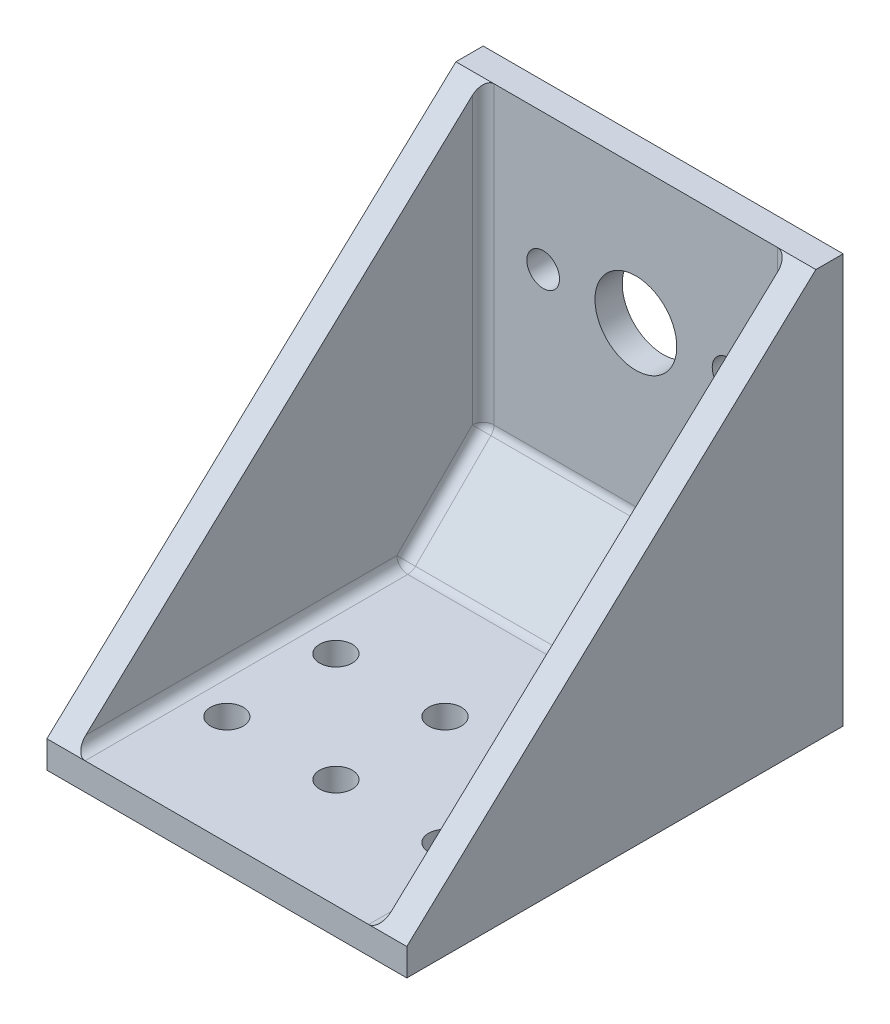
ISO-10303-21;
HEADER;
FILE_DESCRIPTION(('STEP AP214'),'2;1');
FILE_NAME('part.step','',(''),(''),'','','');
FILE_SCHEMA(('AUTOMOTIVE_DESIGN { 1 0 10303 214 1 1 1 1 }'));
ENDSEC;
DATA;
#1=APPLICATION_CONTEXT('core data for automotive mechanical design processes');
#2=APPLICATION_PROTOCOL_DEFINITION('international standard','automotive_design',2000,#1);
#3=PRODUCT_CONTEXT('',#1,'mechanical');
#4=PRODUCT('Part','Part','',(#3));
#5=PRODUCT_RELATED_PRODUCT_CATEGORY('part','',(#4));
#6=PRODUCT_DEFINITION_FORMATION('','',#4);
#7=PRODUCT_DEFINITION_CONTEXT('part definition',#1,'design');
#8=PRODUCT_DEFINITION('design','',#6,#7);
#9=PRODUCT_DEFINITION_SHAPE('','',#8);
#10=(LENGTH_UNIT() NAMED_UNIT(*) SI_UNIT(.MILLI.,.METRE.));
#11=(NAMED_UNIT(*) PLANE_ANGLE_UNIT() SI_UNIT($,.RADIAN.));
#12=(NAMED_UNIT(*) SI_UNIT($,.STERADIAN.) SOLID_ANGLE_UNIT());
#13=UNCERTAINTY_MEASURE_WITH_UNIT(LENGTH_MEASURE(1.E-05),#10,'distance_accuracy_value','');
#14=(GEOMETRIC_REPRESENTATION_CONTEXT(3) GLOBAL_UNCERTAINTY_ASSIGNED_CONTEXT((#13)) GLOBAL_UNIT_ASSIGNED_CONTEXT((#10,
#11,#12)) REPRESENTATION_CONTEXT('',''));
#15=CARTESIAN_POINT('',(0.,0.,0.));
#16=DIRECTION('',(0.,0.,1.));
#17=DIRECTION('',(1.,0.,0.));
#18=AXIS2_PLACEMENT_3D('',#15,#16,#17);
#19=CARTESIAN_POINT('',(28.,0.,0.));
#20=DIRECTION('',(0.,0.,1.));
#21=DIRECTION('',(0.,-1.,0.));
#22=AXIS2_PLACEMENT_3D('',#19,#20,#21);
#23=PLANE('',#22);
#24=CARTESIAN_POINT('',(22.5,25.,0.));
#25=DIRECTION('',(0.,0.,-1.));
#26=DIRECTION('',(0.,1.,0.));
#27=AXIS2_PLACEMENT_3D('',#24,#25,#26);
#28=CIRCLE('',#27,1.49999999999999);
#29=CARTESIAN_POINT('',(22.5,26.5,0.));
#30=VERTEX_POINT('',#29);
#31=EDGE_CURVE('E232',#30,#30,#28,.T.);
#32=ORIENTED_EDGE('',*,*,#31,.F.);
#33=EDGE_LOOP('',(#32));
#34=FACE_BOUND('',#33,.T.);
#35=CARTESIAN_POINT('',(5.5,25.,0.));
#36=DIRECTION('',(0.,0.,-1.));
#37=DIRECTION('',(0.,1.,0.));
#38=AXIS2_PLACEMENT_3D('',#35,#36,#37);
#39=CIRCLE('',#38,1.49999999999999);
#40=CARTESIAN_POINT('',(5.5,26.5,0.));
#41=VERTEX_POINT('',#40);
#42=EDGE_CURVE('E228',#41,#41,#39,.T.);
#43=ORIENTED_EDGE('',*,*,#42,.F.);
#44=EDGE_LOOP('',(#43));
#45=FACE_BOUND('',#44,.T.);
#46=CARTESIAN_POINT('',(14.,25.,0.));
#47=DIRECTION('',(0.,0.,-1.));
#48=DIRECTION('',(0.,1.,0.));
#49=AXIS2_PLACEMENT_3D('',#46,#47,#48);
#50=CIRCLE('',#49,3.74999999999999);
#51=CARTESIAN_POINT('',(14.,28.75,0.));
#52=VERTEX_POINT('',#51);
#53=EDGE_CURVE('E227',#52,#52,#50,.T.);
#54=ORIENTED_EDGE('',*,*,#53,.F.);
#55=EDGE_LOOP('',(#54));
#56=FACE_BOUND('',#55,.T.);
#57=DIRECTION('',(0.,1.,0.));
#58=VECTOR('',#57,1.);
#59=CARTESIAN_POINT('',(30.5,37.5,0.));
#60=LINE('',#59,#58);
#61=CARTESIAN_POINT('',(30.5,0.,0.));
#62=VERTEX_POINT('',#61);
#63=CARTESIAN_POINT('',(30.5,37.5,0.));
#64=VERTEX_POINT('',#63);
#65=EDGE_CURVE('E145',#62,#64,#60,.T.);
#66=ORIENTED_EDGE('',*,*,#65,.F.);
#67=DIRECTION('',(1.,0.,0.));
#68=VECTOR('',#67,1.);
#69=CARTESIAN_POINT('',(30.5,0.,0.));
#70=LINE('',#69,#68);
#71=CARTESIAN_POINT('',(-2.5,0.,0.));
#72=VERTEX_POINT('',#71);
#73=EDGE_CURVE('E149',#72,#62,#70,.T.);
#74=ORIENTED_EDGE('',*,*,#73,.F.);
#75=DIRECTION('',(0.,-1.,0.));
#76=VECTOR('',#75,1.);
#77=CARTESIAN_POINT('',(-2.5,2.5,0.));
#78=LINE('',#77,#76);
#79=CARTESIAN_POINT('',(-2.5,37.5,0.));
#80=VERTEX_POINT('',#79);
#81=EDGE_CURVE('E188',#80,#72,#78,.T.);
#82=ORIENTED_EDGE('',*,*,#81,.F.);
#83=DIRECTION('',(-1.,0.,0.));
#84=VECTOR('',#83,1.);
#85=CARTESIAN_POINT('',(0.,37.5,0.));
#86=LINE('',#85,#84);
#87=EDGE_CURVE('E150',#64,#80,#86,.T.);
#88=ORIENTED_EDGE('',*,*,#87,.F.);
#89=EDGE_LOOP('',(#66,#74,#82,#88));
#90=FACE_BOUND('',#89,.T.);
#91=ADVANCED_FACE('F40',(#34,#45,#56,#90),#23,.F.);
#92=CARTESIAN_POINT('',(28.,10.,2.49999999999999));
#93=DIRECTION('',(0.,-0.707106781186548,-0.707106781186548));
#94=DIRECTION('',(0.,0.707106781186548,-0.707106781186548));
#95=AXIS2_PLACEMENT_3D('',#92,#93,#94);
#96=PLANE('',#95);
#97=DIRECTION('',(1.,0.,0.));
#98=VECTOR('',#97,1.);
#99=CARTESIAN_POINT('',(0.,9.70710678118655,2.79289321881345));
#100=LINE('',#99,#98);
#101=CARTESIAN_POINT('',(27.,9.70710678118655,2.79289321881345));
#102=VERTEX_POINT('',#101);
#103=CARTESIAN_POINT('',(1.,9.70710678118655,2.79289321881345));
#104=VERTEX_POINT('',#103);
#105=EDGE_CURVE('E247',#102,#104,#100,.F.);
#106=ORIENTED_EDGE('',*,*,#105,.T.);
#107=DIRECTION('',(0.,-0.707106781186548,0.707106781186548));
#108=VECTOR('',#107,1.);
#109=CARTESIAN_POINT('',(1.,2.5,10.));
#110=LINE('',#109,#108);
#111=CARTESIAN_POINT('',(1.,2.79289321881345,9.70710678118655));
#112=VERTEX_POINT('',#111);
#113=EDGE_CURVE('E251',#104,#112,#110,.T.);
#114=ORIENTED_EDGE('',*,*,#113,.T.);
#115=DIRECTION('',(1.,0.,0.));
#116=VECTOR('',#115,1.);
#117=CARTESIAN_POINT('',(28.,2.79289321881345,9.70710678118655));
#118=LINE('',#117,#116);
#119=CARTESIAN_POINT('',(27.,2.79289321881345,9.70710678118655));
#120=VERTEX_POINT('',#119);
#121=EDGE_CURVE('E249',#112,#120,#118,.T.);
#122=ORIENTED_EDGE('',*,*,#121,.T.);
#123=DIRECTION('',(0.,0.707106781186548,-0.707106781186548));
#124=VECTOR('',#123,1.);
#125=CARTESIAN_POINT('',(27.,10.,2.49999999999999));
#126=LINE('',#125,#124);
#127=EDGE_CURVE('E245',#120,#102,#126,.T.);
#128=ORIENTED_EDGE('',*,*,#127,.T.);
#129=EDGE_LOOP('',(#106,#114,#122,#128));
#130=FACE_BOUND('',#129,.T.);
#131=ADVANCED_FACE('F390',(#130),#96,.F.);
#132=CARTESIAN_POINT('',(28.,37.5,2.5));
#133=DIRECTION('',(0.,0.,-1.));
#134=DIRECTION('',(-1.,0.,0.));
#135=AXIS2_PLACEMENT_3D('',#132,#133,#134);
#136=PLANE('',#135);
#137=CARTESIAN_POINT('',(22.5,25.,2.5));
#138=DIRECTION('',(0.,0.,-1.));
#139=DIRECTION('',(-1.,0.,0.));
#140=AXIS2_PLACEMENT_3D('',#137,#138,#139);
#141=CIRCLE('',#140,1.49999999999999);
#142=CARTESIAN_POINT('',(21.,25.,2.5));
#143=VERTEX_POINT('',#142);
#144=EDGE_CURVE('E229',#143,#143,#141,.T.);
#145=ORIENTED_EDGE('',*,*,#144,.T.);
#146=EDGE_LOOP('',(#145));
#147=FACE_BOUND('',#146,.T.);
#148=CARTESIAN_POINT('',(5.5,25.,2.5));
#149=DIRECTION('',(0.,0.,-1.));
#150=DIRECTION('',(-1.,0.,0.));
#151=AXIS2_PLACEMENT_3D('',#148,#149,#150);
#152=CIRCLE('',#151,1.49999999999999);
#153=CARTESIAN_POINT('',(4.00000000000001,25.,2.5));
#154=VERTEX_POINT('',#153);
#155=EDGE_CURVE('E224',#154,#154,#152,.T.);
#156=ORIENTED_EDGE('',*,*,#155,.T.);
#157=EDGE_LOOP('',(#156));
#158=FACE_BOUND('',#157,.T.);
#159=CARTESIAN_POINT('',(14.,25.,2.5));
#160=DIRECTION('',(0.,0.,-1.));
#161=DIRECTION('',(-1.,0.,0.));
#162=AXIS2_PLACEMENT_3D('',#159,#160,#161);
#163=CIRCLE('',#162,3.74999999999998);
#164=CARTESIAN_POINT('',(10.25,25.,2.5));
#165=VERTEX_POINT('',#164);
#166=EDGE_CURVE('E321',#165,#165,#163,.T.);
#167=ORIENTED_EDGE('',*,*,#166,.T.);
#168=EDGE_LOOP('',(#167));
#169=FACE_BOUND('',#168,.T.);
#170=DIRECTION('',(1.,0.,0.));
#171=VECTOR('',#170,1.);
#172=CARTESIAN_POINT('',(28.,37.5,2.5));
#173=LINE('',#172,#171);
#174=CARTESIAN_POINT('',(1.,37.5,2.5));
#175=VERTEX_POINT('',#174);
#176=CARTESIAN_POINT('',(27.,37.5,2.5));
#177=VERTEX_POINT('',#176);
#178=EDGE_CURVE('E206',#175,#177,#173,.T.);
#179=ORIENTED_EDGE('',*,*,#178,.F.);
#180=DIRECTION('',(0.,-1.,0.));
#181=VECTOR('',#180,1.);
#182=CARTESIAN_POINT('',(1.,10.,2.5));
#183=LINE('',#182,#181);
#184=CARTESIAN_POINT('',(1.,10.4142135623731,2.5));
#185=VERTEX_POINT('',#184);
#186=EDGE_CURVE('E259',#175,#185,#183,.T.);
#187=ORIENTED_EDGE('',*,*,#186,.T.);
#188=DIRECTION('',(1.,0.,0.));
#189=VECTOR('',#188,1.);
#190=CARTESIAN_POINT('',(28.,10.4142135623731,2.5));
#191=LINE('',#190,#189);
#192=CARTESIAN_POINT('',(27.,10.4142135623731,2.5));
#193=VERTEX_POINT('',#192);
#194=EDGE_CURVE('E257',#185,#193,#191,.T.);
#195=ORIENTED_EDGE('',*,*,#194,.T.);
#196=DIRECTION('',(0.,-1.,0.));
#197=VECTOR('',#196,1.);
#198=CARTESIAN_POINT('',(27.,37.5,2.5));
#199=LINE('',#198,#197);
#200=EDGE_CURVE('E254',#193,#177,#199,.F.);
#201=ORIENTED_EDGE('',*,*,#200,.T.);
#202=EDGE_LOOP('',(#179,#187,#195,#201));
#203=FACE_BOUND('',#202,.T.);
#204=ADVANCED_FACE('F396',(#147,#158,#169,#203),#136,.F.);
#205=CARTESIAN_POINT('',(0.,37.5,0.));
#206=DIRECTION('',(0.,-1.,0.));
#207=DIRECTION('',(0.,0.,-1.));
#208=AXIS2_PLACEMENT_3D('',#205,#206,#207);
#209=PLANE('',#208);
#210=ORIENTED_EDGE('',*,*,#87,.T.);
#211=DIRECTION('',(0.,0.,-1.));
#212=VECTOR('',#211,1.);
#213=CARTESIAN_POINT('',(-2.5,37.5,0.));
#214=LINE('',#213,#212);
#215=CARTESIAN_POINT('',(-2.5,37.5,2.5));
#216=VERTEX_POINT('',#215);
#217=EDGE_CURVE('E185',#216,#80,#214,.T.);
#218=ORIENTED_EDGE('',*,*,#217,.F.);
#219=DIRECTION('',(1.,0.,0.));
#220=VECTOR('',#219,1.);
#221=CARTESIAN_POINT('',(-2.5,37.5,2.5));
#222=LINE('',#221,#220);
#223=EDGE_CURVE('E194',#216,#175,#222,.T.);
#224=ORIENTED_EDGE('',*,*,#223,.T.);
#225=ORIENTED_EDGE('',*,*,#178,.T.);
#226=DIRECTION('',(-1.,0.,0.));
#227=VECTOR('',#226,1.);
#228=CARTESIAN_POINT('',(30.5,37.5,2.5));
#229=LINE('',#228,#227);
#230=CARTESIAN_POINT('',(30.5,37.5,2.5));
#231=VERTEX_POINT('',#230);
#232=EDGE_CURVE('E202',#231,#177,#229,.T.);
#233=ORIENTED_EDGE('',*,*,#232,.F.);
#234=DIRECTION('',(0.,0.,1.));
#235=VECTOR('',#234,1.);
#236=CARTESIAN_POINT('',(30.5,37.5,2.5));
#237=LINE('',#236,#235);
#238=EDGE_CURVE('E153',#64,#231,#237,.T.);
#239=ORIENTED_EDGE('',*,*,#238,.F.);
#240=EDGE_LOOP('',(#210,#218,#224,#225,#233,#239));
#241=FACE_BOUND('',#240,.T.);
#242=ADVANCED_FACE('F676',(#241),#209,.F.);
#243=CARTESIAN_POINT('',(30.5,2.5,40.));
#244=DIRECTION('',(0.,-0.731055268242869,-0.682318250360011));
#245=DIRECTION('',(0.,0.682318250360011,-0.731055268242869));
#246=AXIS2_PLACEMENT_3D('',#243,#244,#245);
#247=PLANE('',#246);
#248=ORIENTED_EDGE('',*,*,#232,.T.);
#249=CARTESIAN_POINT('',(27.,36.5666666666667,3.5));
#250=DIRECTION('',(0.,-0.731055268242869,-0.682318250360011));
#251=DIRECTION('',(0.,-0.682318250360011,0.731055268242869));
#252=AXIS2_PLACEMENT_3D('',#249,#250,#251);
#253=ELLIPSE('',#252,1.36788563524555,1.);
#254=CARTESIAN_POINT('',(28.,36.5666666666667,3.49999999999999));
#255=VERTEX_POINT('',#254);
#256=EDGE_CURVE('E12',#177,#255,#253,.T.);
#257=ORIENTED_EDGE('',*,*,#256,.T.);
#258=DIRECTION('',(0.,-0.682318250360011,0.731055268242869));
#259=VECTOR('',#258,1.);
#260=CARTESIAN_POINT('',(28.,2.5,40.));
#261=LINE('',#260,#259);
#262=CARTESIAN_POINT('',(28.,3.5,38.9285714285714));
#263=VERTEX_POINT('',#262);
#264=EDGE_CURVE('E154',#255,#263,#261,.T.);
#265=ORIENTED_EDGE('',*,*,#264,.T.);
#266=CARTESIAN_POINT('',(27.,3.5,38.9285714285714));
#267=DIRECTION('',(0.,-0.731055268242869,-0.682318250360011));
#268=DIRECTION('',(0.,-0.682318250360011,0.731055268242869));
#269=AXIS2_PLACEMENT_3D('',#266,#267,#268);
#270=ELLIPSE('',#269,1.4655917520488,1.);
#271=CARTESIAN_POINT('',(27.,2.5,40.));
#272=VERTEX_POINT('',#271);
#273=EDGE_CURVE('E50',#263,#272,#270,.T.);
#274=ORIENTED_EDGE('',*,*,#273,.T.);
#275=DIRECTION('',(-1.,0.,0.));
#276=VECTOR('',#275,1.);
#277=CARTESIAN_POINT('',(30.5,2.5,40.));
#278=LINE('',#277,#276);
#279=CARTESIAN_POINT('',(30.5,2.5,40.));
#280=VERTEX_POINT('',#279);
#281=EDGE_CURVE('E58',#280,#272,#278,.T.);
#282=ORIENTED_EDGE('',*,*,#281,.F.);
#283=DIRECTION('',(0.,-0.682318250360011,0.731055268242869));
#284=VECTOR('',#283,1.);
#285=CARTESIAN_POINT('',(30.5,2.5,40.));
#286=LINE('',#285,#284);
#287=EDGE_CURVE('E197',#231,#280,#286,.T.);
#288=ORIENTED_EDGE('',*,*,#287,.F.);
#289=EDGE_LOOP('',(#248,#257,#265,#274,#282,#288));
#290=FACE_BOUND('',#289,.T.);
#291=ADVANCED_FACE('F402',(#290),#247,.F.);
#292=CARTESIAN_POINT('',(30.5,0.,0.));
#293=DIRECTION('',(-1.,0.,0.));
#294=DIRECTION('',(0.,0.,1.));
#295=AXIS2_PLACEMENT_3D('',#292,#293,#294);
#296=PLANE('',#295);
#297=ORIENTED_EDGE('',*,*,#65,.T.);
#298=ORIENTED_EDGE('',*,*,#238,.T.);
#299=ORIENTED_EDGE('',*,*,#287,.T.);
#300=DIRECTION('',(0.,1.,0.));
#301=VECTOR('',#300,1.);
#302=CARTESIAN_POINT('',(30.5,0.,40.));
#303=LINE('',#302,#301);
#304=CARTESIAN_POINT('',(30.5,0.,40.));
#305=VERTEX_POINT('',#304);
#306=EDGE_CURVE('E159',#305,#280,#303,.T.);
#307=ORIENTED_EDGE('',*,*,#306,.F.);
#308=DIRECTION('',(0.,0.,1.));
#309=VECTOR('',#308,1.);
#310=CARTESIAN_POINT('',(30.5,0.,40.));
#311=LINE('',#310,#309);
#312=EDGE_CURVE('E157',#62,#305,#311,.T.);
#313=ORIENTED_EDGE('',*,*,#312,.F.);
#314=EDGE_LOOP('',(#297,#298,#299,#307,#313));
#315=FACE_BOUND('',#314,.T.);
#316=ADVANCED_FACE('F158',(#315),#296,.F.);
#317=CARTESIAN_POINT('',(28.,0.,0.));
#318=DIRECTION('',(-1.,0.,0.));
#319=DIRECTION('',(0.,0.,1.));
#320=AXIS2_PLACEMENT_3D('',#317,#318,#319);
#321=PLANE('',#320);
#322=DIRECTION('',(0.,0.707106781186548,-0.707106781186548));
#323=VECTOR('',#322,1.);
#324=CARTESIAN_POINT('',(28.,6.95710678118655,6.95710678118655));
#325=LINE('',#324,#323);
#326=CARTESIAN_POINT('',(28.,10.4142135623731,3.5));
#327=VERTEX_POINT('',#326);
#328=CARTESIAN_POINT('',(28.,3.5,10.4142135623731));
#329=VERTEX_POINT('',#328);
#330=EDGE_CURVE('E263',#327,#329,#325,.F.);
#331=ORIENTED_EDGE('',*,*,#330,.T.);
#332=DIRECTION('',(0.,0.,-1.));
#333=VECTOR('',#332,1.);
#334=CARTESIAN_POINT('',(28.,3.5,40.));
#335=LINE('',#334,#333);
#336=EDGE_CURVE('E265',#329,#263,#335,.F.);
#337=ORIENTED_EDGE('',*,*,#336,.T.);
#338=ORIENTED_EDGE('',*,*,#264,.F.);
#339=DIRECTION('',(0.,-1.,0.));
#340=VECTOR('',#339,1.);
#341=CARTESIAN_POINT('',(28.,0.,3.5));
#342=LINE('',#341,#340);
#343=EDGE_CURVE('E261',#255,#327,#342,.T.);
#344=ORIENTED_EDGE('',*,*,#343,.T.);
#345=EDGE_LOOP('',(#331,#337,#338,#344));
#346=FACE_BOUND('',#345,.T.);
#347=ADVANCED_FACE('F407',(#346),#321,.T.);
#348=CARTESIAN_POINT('',(-2.5,37.5,2.5));
#349=DIRECTION('',(0.,-0.731055268242869,-0.682318250360011));
#350=DIRECTION('',(0.,0.682318250360011,-0.731055268242869));
#351=AXIS2_PLACEMENT_3D('',#348,#349,#350);
#352=PLANE('',#351);
#353=DIRECTION('',(1.,0.,0.));
#354=VECTOR('',#353,1.);
#355=CARTESIAN_POINT('',(-2.5,2.5,40.));
#356=LINE('',#355,#354);
#357=CARTESIAN_POINT('',(-2.5,2.5,40.));
#358=VERTEX_POINT('',#357);
#359=CARTESIAN_POINT('',(1.,2.5,40.));
#360=VERTEX_POINT('',#359);
#361=EDGE_CURVE('E190',#358,#360,#356,.T.);
#362=ORIENTED_EDGE('',*,*,#361,.T.);
#363=CARTESIAN_POINT('',(1.,3.5,38.9285714285714));
#364=DIRECTION('',(0.,-0.731055268242869,-0.682318250360011));
#365=DIRECTION('',(0.,-0.682318250360011,0.731055268242869));
#366=AXIS2_PLACEMENT_3D('',#363,#364,#365);
#367=ELLIPSE('',#366,1.4655917520488,1.);
#368=CARTESIAN_POINT('',(0.,3.5,38.9285714285714));
#369=VERTEX_POINT('',#368);
#370=EDGE_CURVE('E267',#360,#369,#367,.T.);
#371=ORIENTED_EDGE('',*,*,#370,.T.);
#372=DIRECTION('',(0.,0.682318250360011,-0.731055268242869));
#373=VECTOR('',#372,1.);
#374=CARTESIAN_POINT('',(0.,37.5,2.5));
#375=LINE('',#374,#373);
#376=CARTESIAN_POINT('',(0.,36.5666666666667,3.5));
#377=VERTEX_POINT('',#376);
#378=EDGE_CURVE('E181',#369,#377,#375,.T.);
#379=ORIENTED_EDGE('',*,*,#378,.T.);
#380=CARTESIAN_POINT('',(1.,36.5666666666667,3.5));
#381=DIRECTION('',(0.,-0.731055268242869,-0.682318250360011));
#382=DIRECTION('',(0.,0.682318250360011,-0.731055268242869));
#383=AXIS2_PLACEMENT_3D('',#380,#381,#382);
#384=ELLIPSE('',#383,1.36788563524555,1.);
#385=EDGE_CURVE('E269',#377,#175,#384,.T.);
#386=ORIENTED_EDGE('',*,*,#385,.T.);
#387=ORIENTED_EDGE('',*,*,#223,.F.);
#388=DIRECTION('',(0.,0.682318250360011,-0.731055268242869));
#389=VECTOR('',#388,1.);
#390=CARTESIAN_POINT('',(-2.5,37.5,2.5));
#391=LINE('',#390,#389);
#392=EDGE_CURVE('E182',#358,#216,#391,.T.);
#393=ORIENTED_EDGE('',*,*,#392,.F.);
#394=EDGE_LOOP('',(#362,#371,#379,#386,#387,#393));
#395=FACE_BOUND('',#394,.T.);
#396=ADVANCED_FACE('F371',(#395),#352,.F.);
#397=CARTESIAN_POINT('',(-2.5,0.,0.));
#398=DIRECTION('',(-1.,0.,0.));
#399=DIRECTION('',(0.,0.,1.));
#400=AXIS2_PLACEMENT_3D('',#397,#398,#399);
#401=PLANE('',#400);
#402=ORIENTED_EDGE('',*,*,#392,.T.);
#403=ORIENTED_EDGE('',*,*,#217,.T.);
#404=ORIENTED_EDGE('',*,*,#81,.T.);
#405=DIRECTION('',(0.,0.,-1.));
#406=VECTOR('',#405,1.);
#407=CARTESIAN_POINT('',(-2.5,0.,0.));
#408=LINE('',#407,#406);
#409=CARTESIAN_POINT('',(-2.5,0.,40.));
#410=VERTEX_POINT('',#409);
#411=EDGE_CURVE('E167',#410,#72,#408,.T.);
#412=ORIENTED_EDGE('',*,*,#411,.F.);
#413=DIRECTION('',(0.,1.,0.));
#414=VECTOR('',#413,1.);
#415=CARTESIAN_POINT('',(-2.5,0.,40.));
#416=LINE('',#415,#414);
#417=EDGE_CURVE('E176',#410,#358,#416,.T.);
#418=ORIENTED_EDGE('',*,*,#417,.T.);
#419=EDGE_LOOP('',(#402,#403,#404,#412,#418));
#420=FACE_BOUND('',#419,.T.);
#421=ADVANCED_FACE('F619',(#420),#401,.T.);
#422=CARTESIAN_POINT('',(0.,0.,0.));
#423=DIRECTION('',(-1.,0.,0.));
#424=DIRECTION('',(0.,0.,1.));
#425=AXIS2_PLACEMENT_3D('',#422,#423,#424);
#426=PLANE('',#425);
#427=ORIENTED_EDGE('',*,*,#378,.F.);
#428=DIRECTION('',(0.,0.,1.));
#429=VECTOR('',#428,1.);
#430=CARTESIAN_POINT('',(0.,3.5,0.));
#431=LINE('',#430,#429);
#432=CARTESIAN_POINT('',(0.,3.5,10.4142135623731));
#433=VERTEX_POINT('',#432);
#434=EDGE_CURVE('E243',#369,#433,#431,.F.);
#435=ORIENTED_EDGE('',*,*,#434,.T.);
#436=DIRECTION('',(0.,-0.707106781186548,0.707106781186548));
#437=VECTOR('',#436,1.);
#438=CARTESIAN_POINT('',(0.,10.7071067811866,3.20710678118654));
#439=LINE('',#438,#437);
#440=CARTESIAN_POINT('',(0.,10.4142135623731,3.5));
#441=VERTEX_POINT('',#440);
#442=EDGE_CURVE('E241',#433,#441,#439,.F.);
#443=ORIENTED_EDGE('',*,*,#442,.T.);
#444=DIRECTION('',(0.,-1.,0.));
#445=VECTOR('',#444,1.);
#446=CARTESIAN_POINT('',(0.,37.5,3.5));
#447=LINE('',#446,#445);
#448=EDGE_CURVE('E239',#441,#377,#447,.F.);
#449=ORIENTED_EDGE('',*,*,#448,.T.);
#450=EDGE_LOOP('',(#427,#435,#443,#449));
#451=FACE_BOUND('',#450,.T.);
#452=ADVANCED_FACE('F375',(#451),#426,.F.);
#453=CARTESIAN_POINT('',(-2.5,0.,40.));
#454=DIRECTION('',(0.,0.,-1.));
#455=DIRECTION('',(0.,1.,0.));
#456=AXIS2_PLACEMENT_3D('',#453,#454,#455);
#457=PLANE('',#456);
#458=ORIENTED_EDGE('',*,*,#281,.T.);
#459=DIRECTION('',(-1.,0.,0.));
#460=VECTOR('',#459,1.);
#461=CARTESIAN_POINT('',(-2.5,2.5,40.));
#462=LINE('',#461,#460);
#463=EDGE_CURVE('E168',#272,#360,#462,.T.);
#464=ORIENTED_EDGE('',*,*,#463,.T.);
#465=ORIENTED_EDGE('',*,*,#361,.F.);
#466=ORIENTED_EDGE('',*,*,#417,.F.);
#467=DIRECTION('',(-1.,0.,0.));
#468=VECTOR('',#467,1.);
#469=CARTESIAN_POINT('',(-2.5,0.,40.));
#470=LINE('',#469,#468);
#471=EDGE_CURVE('E162',#305,#410,#470,.T.);
#472=ORIENTED_EDGE('',*,*,#471,.F.);
#473=ORIENTED_EDGE('',*,*,#306,.T.);
#474=EDGE_LOOP('',(#458,#464,#465,#466,#472,#473));
#475=FACE_BOUND('',#474,.T.);
#476=ADVANCED_FACE('F607',(#475),#457,.F.);
#477=CARTESIAN_POINT('',(0.,0.,0.));
#478=DIRECTION('',(0.,1.,0.));
#479=DIRECTION('',(0.,0.,1.));
#480=AXIS2_PLACEMENT_3D('',#477,#478,#479);
#481=PLANE('',#480);
#482=CARTESIAN_POINT('',(3.99999999999997,0.,29.9999999999999));
#483=DIRECTION('',(0.,-1.,0.));
#484=DIRECTION('',(0.,0.,-1.));
#485=AXIS2_PLACEMENT_3D('',#482,#483,#484);
#486=CIRCLE('',#485,1.49999999999999);
#487=CARTESIAN_POINT('',(3.99999999999997,0.,28.4999999999999));
#488=VERTEX_POINT('',#487);
#489=EDGE_CURVE('E223',#488,#488,#486,.T.);
#490=ORIENTED_EDGE('',*,*,#489,.F.);
#491=EDGE_LOOP('',(#490));
#492=FACE_BOUND('',#491,.T.);
#493=CARTESIAN_POINT('',(4.,0.,19.9999999999999));
#494=DIRECTION('',(0.,-1.,0.));
#495=DIRECTION('',(0.,0.,-1.));
#496=AXIS2_PLACEMENT_3D('',#493,#494,#495);
#497=CIRCLE('',#496,1.49999999999999);
#498=CARTESIAN_POINT('',(4.,0.,18.4999999999999));
#499=VERTEX_POINT('',#498);
#500=EDGE_CURVE('E222',#499,#499,#497,.T.);
#501=ORIENTED_EDGE('',*,*,#500,.F.);
#502=EDGE_LOOP('',(#501));
#503=FACE_BOUND('',#502,.T.);
#504=CARTESIAN_POINT('',(14.,0.,29.9999999999999));
#505=DIRECTION('',(0.,-1.,0.));
#506=DIRECTION('',(0.,0.,-1.));
#507=AXIS2_PLACEMENT_3D('',#504,#505,#506);
#508=CIRCLE('',#507,1.49999999999999);
#509=CARTESIAN_POINT('',(14.,0.,28.4999999999999));
#510=VERTEX_POINT('',#509);
#511=EDGE_CURVE('E218',#510,#510,#508,.T.);
#512=ORIENTED_EDGE('',*,*,#511,.F.);
#513=EDGE_LOOP('',(#512));
#514=FACE_BOUND('',#513,.T.);
#515=CARTESIAN_POINT('',(14.,0.,19.9999999999999));
#516=DIRECTION('',(0.,-1.,0.));
#517=DIRECTION('',(0.,0.,-1.));
#518=AXIS2_PLACEMENT_3D('',#515,#516,#517);
#519=CIRCLE('',#518,1.49999999999999);
#520=CARTESIAN_POINT('',(14.,0.,18.4999999999999));
#521=VERTEX_POINT('',#520);
#522=EDGE_CURVE('E214',#521,#521,#519,.T.);
#523=ORIENTED_EDGE('',*,*,#522,.F.);
#524=EDGE_LOOP('',(#523));
#525=FACE_BOUND('',#524,.T.);
#526=CARTESIAN_POINT('',(24.,0.,30.));
#527=DIRECTION('',(0.,-1.,0.));
#528=DIRECTION('',(0.,0.,-1.));
#529=AXIS2_PLACEMENT_3D('',#526,#527,#528);
#530=CIRCLE('',#529,1.49999999999999);
#531=CARTESIAN_POINT('',(24.,0.,28.5));
#532=VERTEX_POINT('',#531);
#533=EDGE_CURVE('E213',#532,#532,#530,.T.);
#534=ORIENTED_EDGE('',*,*,#533,.F.);
#535=EDGE_LOOP('',(#534));
#536=FACE_BOUND('',#535,.T.);
#537=CARTESIAN_POINT('',(24.,0.,20.));
#538=DIRECTION('',(0.,-1.,0.));
#539=DIRECTION('',(0.,0.,-1.));
#540=AXIS2_PLACEMENT_3D('',#537,#538,#539);
#541=CIRCLE('',#540,1.49999999999999);
#542=CARTESIAN_POINT('',(24.,0.,18.5));
#543=VERTEX_POINT('',#542);
#544=EDGE_CURVE('E339',#543,#543,#541,.T.);
#545=ORIENTED_EDGE('',*,*,#544,.F.);
#546=EDGE_LOOP('',(#545));
#547=FACE_BOUND('',#546,.T.);
#548=ORIENTED_EDGE('',*,*,#73,.T.);
#549=ORIENTED_EDGE('',*,*,#312,.T.);
#550=ORIENTED_EDGE('',*,*,#471,.T.);
#551=ORIENTED_EDGE('',*,*,#411,.T.);
#552=EDGE_LOOP('',(#548,#549,#550,#551));
#553=FACE_BOUND('',#552,.T.);
#554=ADVANCED_FACE('F165',(#492,#503,#514,#525,#536,#547,#553),#481,.F.);
#555=CARTESIAN_POINT('',(0.,2.5,0.));
#556=DIRECTION('',(0.,1.,0.));
#557=DIRECTION('',(0.,0.,1.));
#558=AXIS2_PLACEMENT_3D('',#555,#556,#557);
#559=PLANE('',#558);
#560=CARTESIAN_POINT('',(3.99999999999997,2.5,29.9999999999999));
#561=DIRECTION('',(0.,1.,0.));
#562=DIRECTION('',(0.,0.,1.));
#563=AXIS2_PLACEMENT_3D('',#560,#561,#562);
#564=CIRCLE('',#563,1.49999999999999);
#565=CARTESIAN_POINT('',(3.99999999999997,2.5,31.4999999999998));
#566=VERTEX_POINT('',#565);
#567=EDGE_CURVE('E219',#566,#566,#564,.T.);
#568=ORIENTED_EDGE('',*,*,#567,.F.);
#569=EDGE_LOOP('',(#568));
#570=FACE_BOUND('',#569,.T.);
#571=CARTESIAN_POINT('',(4.,2.5,19.9999999999999));
#572=DIRECTION('',(0.,1.,0.));
#573=DIRECTION('',(0.,0.,1.));
#574=AXIS2_PLACEMENT_3D('',#571,#572,#573);
#575=CIRCLE('',#574,1.49999999999999);
#576=CARTESIAN_POINT('',(4.,2.5,21.4999999999999));
#577=VERTEX_POINT('',#576);
#578=EDGE_CURVE('E328',#577,#577,#575,.T.);
#579=ORIENTED_EDGE('',*,*,#578,.F.);
#580=EDGE_LOOP('',(#579));
#581=FACE_BOUND('',#580,.T.);
#582=CARTESIAN_POINT('',(14.,2.5,29.9999999999999));
#583=DIRECTION('',(0.,1.,0.));
#584=DIRECTION('',(0.,0.,1.));
#585=AXIS2_PLACEMENT_3D('',#582,#583,#584);
#586=CIRCLE('',#585,1.49999999999999);
#587=CARTESIAN_POINT('',(14.,2.5,31.4999999999999));
#588=VERTEX_POINT('',#587);
#589=EDGE_CURVE('E215',#588,#588,#586,.T.);
#590=ORIENTED_EDGE('',*,*,#589,.F.);
#591=EDGE_LOOP('',(#590));
#592=FACE_BOUND('',#591,.T.);
#593=CARTESIAN_POINT('',(14.,2.5,19.9999999999999));
#594=DIRECTION('',(0.,1.,0.));
#595=DIRECTION('',(0.,0.,1.));
#596=AXIS2_PLACEMENT_3D('',#593,#594,#595);
#597=CIRCLE('',#596,1.49999999999999);
#598=CARTESIAN_POINT('',(14.,2.5,21.4999999999999));
#599=VERTEX_POINT('',#598);
#600=EDGE_CURVE('E210',#599,#599,#597,.T.);
#601=ORIENTED_EDGE('',*,*,#600,.F.);
#602=EDGE_LOOP('',(#601));
#603=FACE_BOUND('',#602,.T.);
#604=CARTESIAN_POINT('',(24.,2.5,30.));
#605=DIRECTION('',(0.,1.,0.));
#606=DIRECTION('',(0.,0.,1.));
#607=AXIS2_PLACEMENT_3D('',#604,#605,#606);
#608=CIRCLE('',#607,1.49999999999999);
#609=CARTESIAN_POINT('',(24.,2.5,31.5));
#610=VERTEX_POINT('',#609);
#611=EDGE_CURVE('E337',#610,#610,#608,.T.);
#612=ORIENTED_EDGE('',*,*,#611,.F.);
#613=EDGE_LOOP('',(#612));
#614=FACE_BOUND('',#613,.T.);
#615=CARTESIAN_POINT('',(24.,2.5,20.));
#616=DIRECTION('',(0.,1.,0.));
#617=DIRECTION('',(0.,0.,1.));
#618=AXIS2_PLACEMENT_3D('',#615,#616,#617);
#619=CIRCLE('',#618,1.49999999999999);
#620=CARTESIAN_POINT('',(24.,2.5,21.5));
#621=VERTEX_POINT('',#620);
#622=EDGE_CURVE('E170',#621,#621,#619,.T.);
#623=ORIENTED_EDGE('',*,*,#622,.F.);
#624=EDGE_LOOP('',(#623));
#625=FACE_BOUND('',#624,.T.);
#626=DIRECTION('',(1.,0.,0.));
#627=VECTOR('',#626,1.);
#628=CARTESIAN_POINT('',(0.,2.5,10.4142135623731));
#629=LINE('',#628,#627);
#630=CARTESIAN_POINT('',(27.,2.5,10.4142135623731));
#631=VERTEX_POINT('',#630);
#632=CARTESIAN_POINT('',(1.,2.5,10.4142135623731));
#633=VERTEX_POINT('',#632);
#634=EDGE_CURVE('E209',#631,#633,#629,.F.);
#635=ORIENTED_EDGE('',*,*,#634,.T.);
#636=DIRECTION('',(0.,0.,1.));
#637=VECTOR('',#636,1.);
#638=CARTESIAN_POINT('',(1.,2.5,0.));
#639=LINE('',#638,#637);
#640=EDGE_CURVE('E236',#633,#360,#639,.T.);
#641=ORIENTED_EDGE('',*,*,#640,.T.);
#642=ORIENTED_EDGE('',*,*,#463,.F.);
#643=DIRECTION('',(0.,0.,-1.));
#644=VECTOR('',#643,1.);
#645=CARTESIAN_POINT('',(27.,2.5,10.));
#646=LINE('',#645,#644);
#647=EDGE_CURVE('E234',#272,#631,#646,.T.);
#648=ORIENTED_EDGE('',*,*,#647,.T.);
#649=EDGE_LOOP('',(#635,#641,#642,#648));
#650=FACE_BOUND('',#649,.T.);
#651=ADVANCED_FACE('F348',(#570,#581,#592,#603,#614,#625,#650),#559,.T.);
#652=CARTESIAN_POINT('',(24.,0.,20.));
#653=DIRECTION('',(0.,-1.,0.));
#654=DIRECTION('',(0.,0.,-1.));
#655=AXIS2_PLACEMENT_3D('',#652,#653,#654);
#656=CYLINDRICAL_SURFACE('',#655,1.49999999999999);
#657=ORIENTED_EDGE('',*,*,#622,.T.);
#658=EDGE_LOOP('',(#657));
#659=FACE_BOUND('',#658,.T.);
#660=ORIENTED_EDGE('',*,*,#544,.T.);
#661=EDGE_LOOP('',(#660));
#662=FACE_BOUND('',#661,.T.);
#663=ADVANCED_FACE('F346',(#659,#662),#656,.F.);
#664=CARTESIAN_POINT('',(24.,0.,30.));
#665=DIRECTION('',(0.,-1.,0.));
#666=DIRECTION('',(0.,0.,-1.));
#667=AXIS2_PLACEMENT_3D('',#664,#665,#666);
#668=CYLINDRICAL_SURFACE('',#667,1.49999999999999);
#669=ORIENTED_EDGE('',*,*,#611,.T.);
#670=EDGE_LOOP('',(#669));
#671=FACE_BOUND('',#670,.T.);
#672=ORIENTED_EDGE('',*,*,#533,.T.);
#673=EDGE_LOOP('',(#672));
#674=FACE_BOUND('',#673,.T.);
#675=ADVANCED_FACE('F578',(#671,#674),#668,.F.);
#676=CARTESIAN_POINT('',(14.,0.,19.9999999999999));
#677=DIRECTION('',(0.,-1.,0.));
#678=DIRECTION('',(0.,0.,-1.));
#679=AXIS2_PLACEMENT_3D('',#676,#677,#678);
#680=CYLINDRICAL_SURFACE('',#679,1.49999999999999);
#681=ORIENTED_EDGE('',*,*,#600,.T.);
#682=EDGE_LOOP('',(#681));
#683=FACE_BOUND('',#682,.T.);
#684=ORIENTED_EDGE('',*,*,#522,.T.);
#685=EDGE_LOOP('',(#684));
#686=FACE_BOUND('',#685,.T.);
#687=ADVANCED_FACE('F569',(#683,#686),#680,.F.);
#688=CARTESIAN_POINT('',(14.,0.,29.9999999999999));
#689=DIRECTION('',(0.,-1.,0.));
#690=DIRECTION('',(0.,0.,-1.));
#691=AXIS2_PLACEMENT_3D('',#688,#689,#690);
#692=CYLINDRICAL_SURFACE('',#691,1.49999999999999);
#693=ORIENTED_EDGE('',*,*,#589,.T.);
#694=EDGE_LOOP('',(#693));
#695=FACE_BOUND('',#694,.T.);
#696=ORIENTED_EDGE('',*,*,#511,.T.);
#697=EDGE_LOOP('',(#696));
#698=FACE_BOUND('',#697,.T.);
#699=ADVANCED_FACE('F560',(#695,#698),#692,.F.);
#700=CARTESIAN_POINT('',(4.,0.,19.9999999999999));
#701=DIRECTION('',(0.,-1.,0.));
#702=DIRECTION('',(0.,0.,-1.));
#703=AXIS2_PLACEMENT_3D('',#700,#701,#702);
#704=CYLINDRICAL_SURFACE('',#703,1.49999999999999);
#705=ORIENTED_EDGE('',*,*,#578,.T.);
#706=EDGE_LOOP('',(#705));
#707=FACE_BOUND('',#706,.T.);
#708=ORIENTED_EDGE('',*,*,#500,.T.);
#709=EDGE_LOOP('',(#708));
#710=FACE_BOUND('',#709,.T.);
#711=ADVANCED_FACE('F551',(#707,#710),#704,.F.);
#712=CARTESIAN_POINT('',(3.99999999999997,0.,29.9999999999999));
#713=DIRECTION('',(0.,-1.,0.));
#714=DIRECTION('',(0.,0.,-1.));
#715=AXIS2_PLACEMENT_3D('',#712,#713,#714);
#716=CYLINDRICAL_SURFACE('',#715,1.49999999999999);
#717=ORIENTED_EDGE('',*,*,#567,.T.);
#718=EDGE_LOOP('',(#717));
#719=FACE_BOUND('',#718,.T.);
#720=ORIENTED_EDGE('',*,*,#489,.T.);
#721=EDGE_LOOP('',(#720));
#722=FACE_BOUND('',#721,.T.);
#723=ADVANCED_FACE('F542',(#719,#722),#716,.F.);
#724=CARTESIAN_POINT('',(14.,25.,0.));
#725=DIRECTION('',(0.,0.,-1.));
#726=DIRECTION('',(0.,1.,0.));
#727=AXIS2_PLACEMENT_3D('',#724,#725,#726);
#728=CYLINDRICAL_SURFACE('',#727,3.74999999999998);
#729=ORIENTED_EDGE('',*,*,#53,.T.);
#730=EDGE_LOOP('',(#729));
#731=FACE_BOUND('',#730,.T.);
#732=ORIENTED_EDGE('',*,*,#166,.F.);
#733=EDGE_LOOP('',(#732));
#734=FACE_BOUND('',#733,.T.);
#735=ADVANCED_FACE('F533',(#731,#734),#728,.F.);
#736=CARTESIAN_POINT('',(5.5,25.,0.));
#737=DIRECTION('',(0.,0.,-1.));
#738=DIRECTION('',(0.,1.,0.));
#739=AXIS2_PLACEMENT_3D('',#736,#737,#738);
#740=CYLINDRICAL_SURFACE('',#739,1.49999999999999);
#741=ORIENTED_EDGE('',*,*,#42,.T.);
#742=EDGE_LOOP('',(#741));
#743=FACE_BOUND('',#742,.T.);
#744=ORIENTED_EDGE('',*,*,#155,.F.);
#745=EDGE_LOOP('',(#744));
#746=FACE_BOUND('',#745,.T.);
#747=ADVANCED_FACE('F524',(#743,#746),#740,.F.);
#748=CARTESIAN_POINT('',(22.5,25.,0.));
#749=DIRECTION('',(0.,0.,-1.));
#750=DIRECTION('',(0.,1.,0.));
#751=AXIS2_PLACEMENT_3D('',#748,#749,#750);
#752=CYLINDRICAL_SURFACE('',#751,1.49999999999999);
#753=ORIENTED_EDGE('',*,*,#31,.T.);
#754=EDGE_LOOP('',(#753));
#755=FACE_BOUND('',#754,.T.);
#756=ORIENTED_EDGE('',*,*,#144,.F.);
#757=EDGE_LOOP('',(#756));
#758=FACE_BOUND('',#757,.T.);
#759=ADVANCED_FACE('F516',(#755,#758),#752,.F.);
#760=CARTESIAN_POINT('',(27.,0.,3.5));
#761=DIRECTION('',(0.,-1.,0.));
#762=DIRECTION('',(0.,0.,-1.));
#763=AXIS2_PLACEMENT_3D('',#760,#761,#762);
#764=CYLINDRICAL_SURFACE('',#763,1.);
#765=CARTESIAN_POINT('',(27.,10.4142135623731,3.5));
#766=DIRECTION('',(0.,1.,0.));
#767=DIRECTION('',(0.,0.,1.));
#768=AXIS2_PLACEMENT_3D('',#765,#766,#767);
#769=CIRCLE('',#768,1.);
#770=EDGE_CURVE('E44',#327,#193,#769,.T.);
#771=ORIENTED_EDGE('',*,*,#770,.F.);
#772=ORIENTED_EDGE('',*,*,#343,.F.);
#773=ORIENTED_EDGE('',*,*,#256,.F.);
#774=ORIENTED_EDGE('',*,*,#200,.F.);
#775=EDGE_LOOP('',(#771,#772,#773,#774));
#776=FACE_BOUND('',#775,.T.);
#777=ADVANCED_FACE('F42',(#776),#764,.F.);
#778=CARTESIAN_POINT('',(27.,10.4142135623731,3.5));
#779=DIRECTION('',(0.,0.,1.));
#780=DIRECTION('',(1.,0.,0.));
#781=AXIS2_PLACEMENT_3D('',#778,#779,#780);
#782=SPHERICAL_SURFACE('',#781,1.);
#783=CARTESIAN_POINT('',(27.,10.4142135623731,3.5));
#784=DIRECTION('',(0.,-0.707106781186548,0.707106781186547));
#785=DIRECTION('',(0.,-0.707106781186547,-0.707106781186548));
#786=AXIS2_PLACEMENT_3D('',#783,#784,#785);
#787=CIRCLE('',#786,1.);
#788=EDGE_CURVE('E300',#327,#102,#787,.F.);
#789=ORIENTED_EDGE('',*,*,#788,.F.);
#790=ORIENTED_EDGE('',*,*,#770,.T.);
#791=CARTESIAN_POINT('',(27.,10.4142135623731,3.5));
#792=DIRECTION('',(-1.,0.,0.));
#793=DIRECTION('',(0.,0.,1.));
#794=AXIS2_PLACEMENT_3D('',#791,#792,#793);
#795=CIRCLE('',#794,1.);
#796=EDGE_CURVE('E302',#102,#193,#795,.F.);
#797=ORIENTED_EDGE('',*,*,#796,.F.);
#798=EDGE_LOOP('',(#789,#790,#797));
#799=FACE_BOUND('',#798,.T.);
#800=ADVANCED_FACE('F502',(#799),#782,.F.);
#801=CARTESIAN_POINT('',(1.,37.5,3.5));
#802=DIRECTION('',(0.,1.,0.));
#803=DIRECTION('',(0.,0.,1.));
#804=AXIS2_PLACEMENT_3D('',#801,#802,#803);
#805=CYLINDRICAL_SURFACE('',#804,1.);
#806=ORIENTED_EDGE('',*,*,#385,.F.);
#807=ORIENTED_EDGE('',*,*,#448,.F.);
#808=CARTESIAN_POINT('',(1.,10.4142135623731,3.5));
#809=DIRECTION('',(0.,1.,0.));
#810=DIRECTION('',(0.,0.,1.));
#811=AXIS2_PLACEMENT_3D('',#808,#809,#810);
#812=CIRCLE('',#811,1.);
#813=EDGE_CURVE('E297',#185,#441,#812,.T.);
#814=ORIENTED_EDGE('',*,*,#813,.F.);
#815=ORIENTED_EDGE('',*,*,#186,.F.);
#816=EDGE_LOOP('',(#806,#807,#814,#815));
#817=FACE_BOUND('',#816,.T.);
#818=ADVANCED_FACE('F380',(#817),#805,.F.);
#819=CARTESIAN_POINT('',(28.,10.4142135623731,3.5));
#820=DIRECTION('',(-1.,0.,0.));
#821=DIRECTION('',(0.,0.,1.));
#822=AXIS2_PLACEMENT_3D('',#819,#820,#821);
#823=CYLINDRICAL_SURFACE('',#822,1.);
#824=ORIENTED_EDGE('',*,*,#796,.T.);
#825=ORIENTED_EDGE('',*,*,#194,.F.);
#826=CARTESIAN_POINT('',(1.,10.4142135623731,3.5));
#827=DIRECTION('',(1.,0.,0.));
#828=DIRECTION('',(0.,0.,-1.));
#829=AXIS2_PLACEMENT_3D('',#826,#827,#828);
#830=CIRCLE('',#829,1.);
#831=EDGE_CURVE('E294',#104,#185,#830,.T.);
#832=ORIENTED_EDGE('',*,*,#831,.F.);
#833=ORIENTED_EDGE('',*,*,#105,.F.);
#834=EDGE_LOOP('',(#824,#825,#832,#833));
#835=FACE_BOUND('',#834,.T.);
#836=ADVANCED_FACE('F392',(#835),#823,.F.);
#837=CARTESIAN_POINT('',(27.,10.7071067811866,3.20710678118654));
#838=DIRECTION('',(0.,0.707106781186548,-0.707106781186548));
#839=DIRECTION('',(0.,0.707106781186548,0.707106781186548));
#840=AXIS2_PLACEMENT_3D('',#837,#838,#839);
#841=CYLINDRICAL_SURFACE('',#840,1.);
#842=ORIENTED_EDGE('',*,*,#788,.T.);
#843=ORIENTED_EDGE('',*,*,#127,.F.);
#844=CARTESIAN_POINT('',(27.,3.5,10.4142135623731));
#845=DIRECTION('',(0.,0.707106781186548,-0.707106781186548));
#846=DIRECTION('',(0.,0.707106781186548,0.707106781186548));
#847=AXIS2_PLACEMENT_3D('',#844,#845,#846);
#848=CIRCLE('',#847,1.);
#849=EDGE_CURVE('E291',#329,#120,#848,.T.);
#850=ORIENTED_EDGE('',*,*,#849,.F.);
#851=ORIENTED_EDGE('',*,*,#330,.F.);
#852=EDGE_LOOP('',(#842,#843,#850,#851));
#853=FACE_BOUND('',#852,.T.);
#854=ADVANCED_FACE('F415',(#853),#841,.F.);
#855=CARTESIAN_POINT('',(27.,3.5,0.));
#856=DIRECTION('',(0.,0.,1.));
#857=DIRECTION('',(1.,0.,0.));
#858=AXIS2_PLACEMENT_3D('',#855,#856,#857);
#859=CYLINDRICAL_SURFACE('',#858,1.);
#860=ORIENTED_EDGE('',*,*,#273,.F.);
#861=ORIENTED_EDGE('',*,*,#336,.F.);
#862=CARTESIAN_POINT('',(27.,3.5,10.4142135623731));
#863=DIRECTION('',(0.,0.,1.));
#864=DIRECTION('',(1.,0.,0.));
#865=AXIS2_PLACEMENT_3D('',#862,#863,#864);
#866=CIRCLE('',#865,1.);
#867=EDGE_CURVE('E288',#631,#329,#866,.T.);
#868=ORIENTED_EDGE('',*,*,#867,.F.);
#869=ORIENTED_EDGE('',*,*,#647,.F.);
#870=EDGE_LOOP('',(#860,#861,#868,#869));
#871=FACE_BOUND('',#870,.T.);
#872=ADVANCED_FACE('F412',(#871),#859,.F.);
#873=CARTESIAN_POINT('',(1.,10.4142135623731,3.5));
#874=DIRECTION('',(0.,0.,1.));
#875=DIRECTION('',(1.,0.,0.));
#876=AXIS2_PLACEMENT_3D('',#873,#874,#875);
#877=SPHERICAL_SURFACE('',#876,1.);
#878=ORIENTED_EDGE('',*,*,#831,.T.);
#879=ORIENTED_EDGE('',*,*,#813,.T.);
#880=CARTESIAN_POINT('',(1.,10.4142135623731,3.5));
#881=DIRECTION('',(0.,-0.707106781186547,0.707106781186548));
#882=DIRECTION('',(0.,-0.707106781186548,-0.707106781186547));
#883=AXIS2_PLACEMENT_3D('',#880,#881,#882);
#884=CIRCLE('',#883,1.);
#885=EDGE_CURVE('E285',#104,#441,#884,.F.);
#886=ORIENTED_EDGE('',*,*,#885,.F.);
#887=EDGE_LOOP('',(#878,#879,#886));
#888=FACE_BOUND('',#887,.T.);
#889=ADVANCED_FACE('F384',(#888),#877,.F.);
#890=CARTESIAN_POINT('',(27.,3.5,10.4142135623731));
#891=DIRECTION('',(0.,0.,1.));
#892=DIRECTION('',(1.,0.,0.));
#893=AXIS2_PLACEMENT_3D('',#890,#891,#892);
#894=SPHERICAL_SURFACE('',#893,1.);
#895=ORIENTED_EDGE('',*,*,#867,.T.);
#896=ORIENTED_EDGE('',*,*,#849,.T.);
#897=CARTESIAN_POINT('',(27.,3.5,10.4142135623731));
#898=DIRECTION('',(-1.,0.,0.));
#899=DIRECTION('',(0.,0.,1.));
#900=AXIS2_PLACEMENT_3D('',#897,#898,#899);
#901=CIRCLE('',#900,1.);
#902=EDGE_CURVE('E282',#631,#120,#901,.F.);
#903=ORIENTED_EDGE('',*,*,#902,.F.);
#904=EDGE_LOOP('',(#895,#896,#903));
#905=FACE_BOUND('',#904,.T.);
#906=ADVANCED_FACE('F417',(#905),#894,.F.);
#907=CARTESIAN_POINT('',(1.,10.7071067811866,3.20710678118654));
#908=DIRECTION('',(0.,0.707106781186548,-0.707106781186548));
#909=DIRECTION('',(0.,0.707106781186548,0.707106781186548));
#910=AXIS2_PLACEMENT_3D('',#907,#908,#909);
#911=CYLINDRICAL_SURFACE('',#910,1.);
#912=ORIENTED_EDGE('',*,*,#885,.T.);
#913=ORIENTED_EDGE('',*,*,#442,.F.);
#914=CARTESIAN_POINT('',(1.,3.5,10.4142135623731));
#915=DIRECTION('',(0.,0.707106781186547,-0.707106781186548));
#916=DIRECTION('',(0.,0.707106781186548,0.707106781186547));
#917=AXIS2_PLACEMENT_3D('',#914,#915,#916);
#918=CIRCLE('',#917,1.);
#919=EDGE_CURVE('E279',#112,#433,#918,.T.);
#920=ORIENTED_EDGE('',*,*,#919,.F.);
#921=ORIENTED_EDGE('',*,*,#113,.F.);
#922=EDGE_LOOP('',(#912,#913,#920,#921));
#923=FACE_BOUND('',#922,.T.);
#924=ADVANCED_FACE('F388',(#923),#911,.F.);
#925=CARTESIAN_POINT('',(28.,3.5,10.4142135623731));
#926=DIRECTION('',(1.,0.,0.));
#927=DIRECTION('',(0.,0.,-1.));
#928=AXIS2_PLACEMENT_3D('',#925,#926,#927);
#929=CYLINDRICAL_SURFACE('',#928,1.);
#930=ORIENTED_EDGE('',*,*,#902,.T.);
#931=ORIENTED_EDGE('',*,*,#121,.F.);
#932=CARTESIAN_POINT('',(1.,3.5,10.4142135623731));
#933=DIRECTION('',(1.,0.,0.));
#934=DIRECTION('',(0.,0.,-1.));
#935=AXIS2_PLACEMENT_3D('',#932,#933,#934);
#936=CIRCLE('',#935,1.);
#937=EDGE_CURVE('E277',#633,#112,#936,.T.);
#938=ORIENTED_EDGE('',*,*,#937,.F.);
#939=ORIENTED_EDGE('',*,*,#634,.F.);
#940=EDGE_LOOP('',(#930,#931,#938,#939));
#941=FACE_BOUND('',#940,.T.);
#942=ADVANCED_FACE('F361',(#941),#929,.F.);
#943=CARTESIAN_POINT('',(1.,3.5,10.4142135623731));
#944=DIRECTION('',(0.,0.,1.));
#945=DIRECTION('',(1.,0.,0.));
#946=AXIS2_PLACEMENT_3D('',#943,#944,#945);
#947=SPHERICAL_SURFACE('',#946,1.);
#948=ORIENTED_EDGE('',*,*,#937,.T.);
#949=ORIENTED_EDGE('',*,*,#919,.T.);
#950=CARTESIAN_POINT('',(1.,3.5,10.4142135623731));
#951=DIRECTION('',(0.,0.,1.));
#952=DIRECTION('',(1.,0.,0.));
#953=AXIS2_PLACEMENT_3D('',#950,#951,#952);
#954=CIRCLE('',#953,1.);
#955=EDGE_CURVE('E274',#633,#433,#954,.F.);
#956=ORIENTED_EDGE('',*,*,#955,.F.);
#957=EDGE_LOOP('',(#948,#949,#956));
#958=FACE_BOUND('',#957,.T.);
#959=ADVANCED_FACE('F364',(#958),#947,.F.);
#960=CARTESIAN_POINT('',(1.,3.5,0.));
#961=DIRECTION('',(0.,0.,1.));
#962=DIRECTION('',(1.,0.,0.));
#963=AXIS2_PLACEMENT_3D('',#960,#961,#962);
#964=CYLINDRICAL_SURFACE('',#963,1.);
#965=ORIENTED_EDGE('',*,*,#955,.T.);
#966=ORIENTED_EDGE('',*,*,#434,.F.);
#967=ORIENTED_EDGE('',*,*,#370,.F.);
#968=ORIENTED_EDGE('',*,*,#640,.F.);
#969=EDGE_LOOP('',(#965,#966,#967,#968));
#970=FACE_BOUND('',#969,.T.);
#971=ADVANCED_FACE('F368',(#970),#964,.F.);
#972=CLOSED_SHELL('',(#91,#131,#204,#242,#291,#316,#347,#396,#421,#452,#476,#554,#651,#663,#675,
#687,#699,#711,#723,#735,#747,#759,#777,#800,#818,#836,#854,#872,#889,#906,#924,#942,#959,#971));
#973=MANIFOLD_SOLID_BREP('B2',#972);
#974=ADVANCED_BREP_SHAPE_REPRESENTATION('',(#18,#973),#14);
#975=SHAPE_DEFINITION_REPRESENTATION(#9,#974);
ENDSEC;
END-ISO-10303-21;
